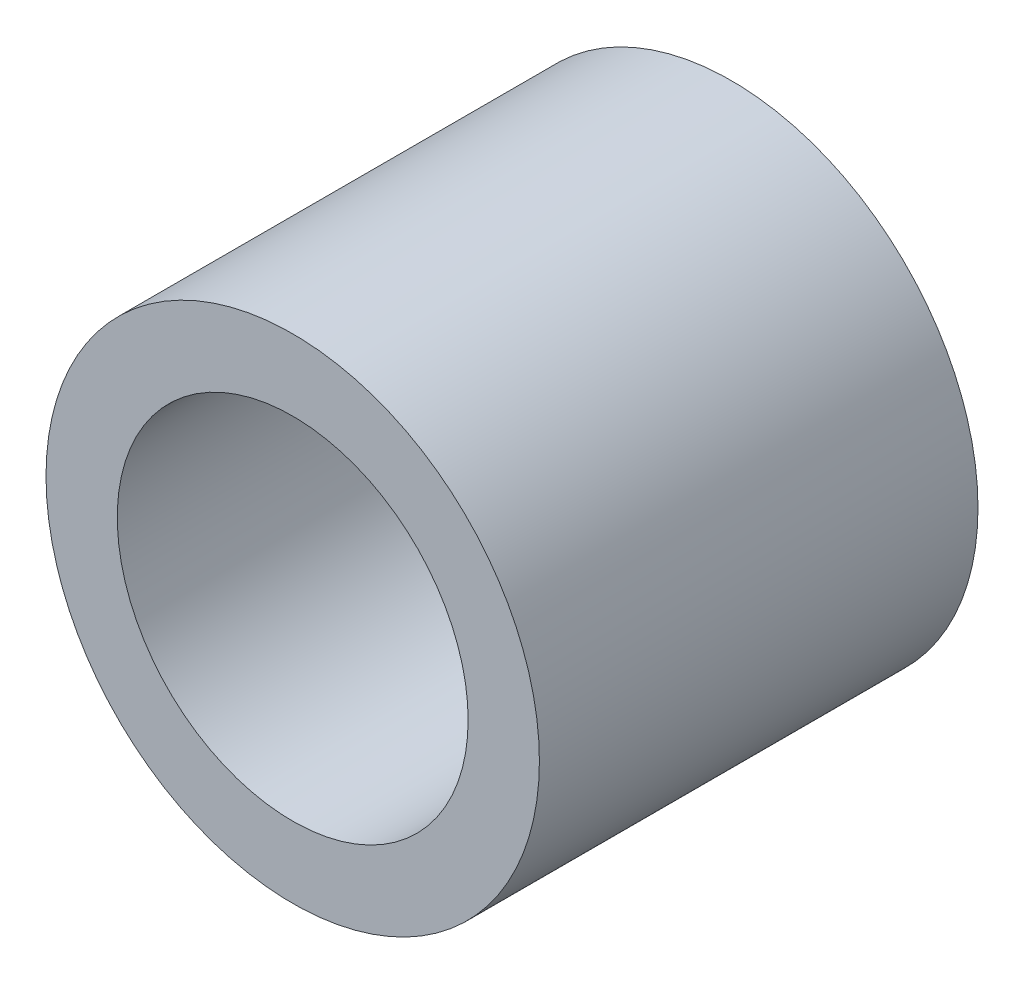
ISO-10303-21;
HEADER;
FILE_DESCRIPTION(('STEP AP214'),'2;1');
FILE_NAME('part.step','',(''),(''),'','','');
FILE_SCHEMA(('AUTOMOTIVE_DESIGN { 1 0 10303 214 1 1 1 1 }'));
ENDSEC;
DATA;
#1=APPLICATION_CONTEXT('core data for automotive mechanical design processes');
#2=APPLICATION_PROTOCOL_DEFINITION('international standard','automotive_design',2000,#1);
#3=PRODUCT_CONTEXT('',#1,'mechanical');
#4=PRODUCT('Part','Part','',(#3));
#5=PRODUCT_RELATED_PRODUCT_CATEGORY('part','',(#4));
#6=PRODUCT_DEFINITION_FORMATION('','',#4);
#7=PRODUCT_DEFINITION_CONTEXT('part definition',#1,'design');
#8=PRODUCT_DEFINITION('design','',#6,#7);
#9=PRODUCT_DEFINITION_SHAPE('','',#8);
#10=(LENGTH_UNIT() NAMED_UNIT(*) SI_UNIT(.MILLI.,.METRE.));
#11=(NAMED_UNIT(*) PLANE_ANGLE_UNIT() SI_UNIT($,.RADIAN.));
#12=(NAMED_UNIT(*) SI_UNIT($,.STERADIAN.) SOLID_ANGLE_UNIT());
#13=UNCERTAINTY_MEASURE_WITH_UNIT(LENGTH_MEASURE(1.E-05),#10,'distance_accuracy_value','');
#14=(GEOMETRIC_REPRESENTATION_CONTEXT(3) GLOBAL_UNCERTAINTY_ASSIGNED_CONTEXT((#13)) GLOBAL_UNIT_ASSIGNED_CONTEXT((#10,
#11,#12)) REPRESENTATION_CONTEXT('',''));
#15=CARTESIAN_POINT('',(0.,0.,0.));
#16=DIRECTION('',(0.,0.,1.));
#17=DIRECTION('',(1.,0.,0.));
#18=AXIS2_PLACEMENT_3D('',#15,#16,#17);
#19=CARTESIAN_POINT('',(0.,0.,2.));
#20=DIRECTION('',(0.,0.,1.));
#21=DIRECTION('',(1.,0.,0.));
#22=AXIS2_PLACEMENT_3D('',#19,#20,#21);
#23=PLANE('',#22);
#24=CARTESIAN_POINT('',(0.,0.,2.));
#25=DIRECTION('',(0.,0.,1.));
#26=DIRECTION('',(1.,0.,0.));
#27=AXIS2_PLACEMENT_3D('',#24,#25,#26);
#28=CIRCLE('',#27,2.25);
#29=CARTESIAN_POINT('',(2.25,0.,2.));
#30=VERTEX_POINT('',#29);
#31=EDGE_CURVE('E10',#30,#30,#28,.T.);
#32=ORIENTED_EDGE('',*,*,#31,.T.);
#33=EDGE_LOOP('',(#32));
#34=FACE_BOUND('',#33,.T.);
#35=CARTESIAN_POINT('',(0.,0.,2.));
#36=DIRECTION('',(0.,0.,1.));
#37=DIRECTION('',(1.,0.,0.));
#38=AXIS2_PLACEMENT_3D('',#35,#36,#37);
#39=CIRCLE('',#38,1.6);
#40=CARTESIAN_POINT('',(1.6,0.,2.));
#41=VERTEX_POINT('',#40);
#42=EDGE_CURVE('E41',#41,#41,#39,.T.);
#43=ORIENTED_EDGE('',*,*,#42,.F.);
#44=EDGE_LOOP('',(#43));
#45=FACE_BOUND('',#44,.T.);
#46=ADVANCED_FACE('F30',(#34,#45),#23,.T.);
#47=CARTESIAN_POINT('',(0.,0.,-2.));
#48=DIRECTION('',(0.,0.,1.));
#49=DIRECTION('',(1.,0.,0.));
#50=AXIS2_PLACEMENT_3D('',#47,#48,#49);
#51=PLANE('',#50);
#52=CARTESIAN_POINT('',(0.,0.,-2.));
#53=DIRECTION('',(0.,0.,1.));
#54=DIRECTION('',(1.,0.,0.));
#55=AXIS2_PLACEMENT_3D('',#52,#53,#54);
#56=CIRCLE('',#55,2.25);
#57=CARTESIAN_POINT('',(2.25,0.,-2.));
#58=VERTEX_POINT('',#57);
#59=EDGE_CURVE('E34',#58,#58,#56,.T.);
#60=ORIENTED_EDGE('',*,*,#59,.F.);
#61=EDGE_LOOP('',(#60));
#62=FACE_BOUND('',#61,.T.);
#63=CARTESIAN_POINT('',(0.,0.,-2.));
#64=DIRECTION('',(0.,0.,1.));
#65=DIRECTION('',(1.,0.,0.));
#66=AXIS2_PLACEMENT_3D('',#63,#64,#65);
#67=CIRCLE('',#66,1.6);
#68=CARTESIAN_POINT('',(1.6,0.,-2.));
#69=VERTEX_POINT('',#68);
#70=EDGE_CURVE('E43',#69,#69,#67,.T.);
#71=ORIENTED_EDGE('',*,*,#70,.T.);
#72=EDGE_LOOP('',(#71));
#73=FACE_BOUND('',#72,.T.);
#74=ADVANCED_FACE('F53',(#62,#73),#51,.F.);
#75=CARTESIAN_POINT('',(0.,0.,2.));
#76=DIRECTION('',(0.,0.,-1.));
#77=DIRECTION('',(-1.,0.,0.));
#78=AXIS2_PLACEMENT_3D('',#75,#76,#77);
#79=CYLINDRICAL_SURFACE('',#78,2.25);
#80=ORIENTED_EDGE('',*,*,#31,.F.);
#81=EDGE_LOOP('',(#80));
#82=FACE_BOUND('',#81,.T.);
#83=ORIENTED_EDGE('',*,*,#59,.T.);
#84=EDGE_LOOP('',(#83));
#85=FACE_BOUND('',#84,.T.);
#86=ADVANCED_FACE('F32',(#82,#85),#79,.T.);
#87=CARTESIAN_POINT('',(0.,0.,2.));
#88=DIRECTION('',(0.,0.,-1.));
#89=DIRECTION('',(-1.,0.,0.));
#90=AXIS2_PLACEMENT_3D('',#87,#88,#89);
#91=CYLINDRICAL_SURFACE('',#90,1.6);
#92=ORIENTED_EDGE('',*,*,#42,.T.);
#93=EDGE_LOOP('',(#92));
#94=FACE_BOUND('',#93,.T.);
#95=ORIENTED_EDGE('',*,*,#70,.F.);
#96=EDGE_LOOP('',(#95));
#97=FACE_BOUND('',#96,.T.);
#98=ADVANCED_FACE('F49',(#94,#97),#91,.F.);
#99=CLOSED_SHELL('',(#46,#74,#86,#98));
#100=MANIFOLD_SOLID_BREP('B2',#99);
#101=ADVANCED_BREP_SHAPE_REPRESENTATION('',(#18,#100),#14);
#102=SHAPE_DEFINITION_REPRESENTATION(#9,#101);
ENDSEC;
END-ISO-10303-21;
